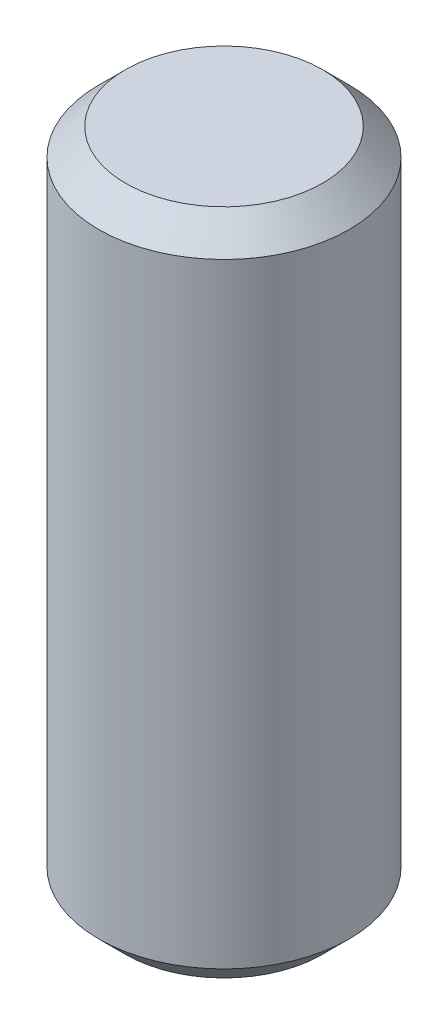
ISO-10303-21;
HEADER;
FILE_DESCRIPTION(('STEP AP214'),'2;1');
FILE_NAME('part.step','',(''),(''),'','','');
FILE_SCHEMA(('AUTOMOTIVE_DESIGN { 1 0 10303 214 1 1 1 1 }'));
ENDSEC;
DATA;
#1=APPLICATION_CONTEXT('core data for automotive mechanical design processes');
#2=APPLICATION_PROTOCOL_DEFINITION('international standard','automotive_design',2000,#1);
#3=PRODUCT_CONTEXT('',#1,'mechanical');
#4=PRODUCT('Part','Part','',(#3));
#5=PRODUCT_RELATED_PRODUCT_CATEGORY('part','',(#4));
#6=PRODUCT_DEFINITION_FORMATION('','',#4);
#7=PRODUCT_DEFINITION_CONTEXT('part definition',#1,'design');
#8=PRODUCT_DEFINITION('design','',#6,#7);
#9=PRODUCT_DEFINITION_SHAPE('','',#8);
#10=(LENGTH_UNIT() NAMED_UNIT(*) SI_UNIT(.MILLI.,.METRE.));
#11=(NAMED_UNIT(*) PLANE_ANGLE_UNIT() SI_UNIT($,.RADIAN.));
#12=(NAMED_UNIT(*) SI_UNIT($,.STERADIAN.) SOLID_ANGLE_UNIT());
#13=UNCERTAINTY_MEASURE_WITH_UNIT(LENGTH_MEASURE(1.E-05),#10,'distance_accuracy_value','');
#14=(GEOMETRIC_REPRESENTATION_CONTEXT(3) GLOBAL_UNCERTAINTY_ASSIGNED_CONTEXT((#13)) GLOBAL_UNIT_ASSIGNED_CONTEXT((#10,
#11,#12)) REPRESENTATION_CONTEXT('',''));
#15=CARTESIAN_POINT('',(0.,0.,0.));
#16=DIRECTION('',(0.,0.,1.));
#17=DIRECTION('',(1.,0.,0.));
#18=AXIS2_PLACEMENT_3D('',#15,#16,#17);
#19=CARTESIAN_POINT('',(0.,-3.175,0.));
#20=DIRECTION('',(0.,1.,0.));
#21=DIRECTION('',(0.,0.,1.));
#22=AXIS2_PLACEMENT_3D('',#19,#20,#21);
#23=PLANE('',#22);
#24=CARTESIAN_POINT('',(0.,-3.175,0.));
#25=DIRECTION('',(0.,1.,0.));
#26=DIRECTION('',(0.,0.,1.));
#27=AXIS2_PLACEMENT_3D('',#24,#25,#26);
#28=CIRCLE('',#27,0.936625000000001);
#29=CARTESIAN_POINT('',(0.,-3.175,0.936625000000001));
#30=VERTEX_POINT('',#29);
#31=EDGE_CURVE('E37',#30,#30,#28,.F.);
#32=ORIENTED_EDGE('',*,*,#31,.T.);
#33=EDGE_LOOP('',(#32));
#34=FACE_BOUND('',#33,.T.);
#35=ADVANCED_FACE('F30',(#34),#23,.F.);
#36=CARTESIAN_POINT('',(0.,0.760475273186752,0.));
#37=DIRECTION('',(0.,1.,0.));
#38=DIRECTION('',(0.,0.,1.));
#39=AXIS2_PLACEMENT_3D('',#36,#37,#38);
#40=CYLINDRICAL_SURFACE('',#39,1.190625);
#41=CARTESIAN_POINT('',(0.,-2.921,0.));
#42=DIRECTION('',(0.,1.,0.));
#43=DIRECTION('',(0.,0.,1.));
#44=AXIS2_PLACEMENT_3D('',#41,#42,#43);
#45=CIRCLE('',#44,1.190625);
#46=CARTESIAN_POINT('',(0.,-2.921,1.190625));
#47=VERTEX_POINT('',#46);
#48=EDGE_CURVE('E41',#47,#47,#45,.T.);
#49=ORIENTED_EDGE('',*,*,#48,.T.);
#50=EDGE_LOOP('',(#49));
#51=FACE_BOUND('',#50,.T.);
#52=CARTESIAN_POINT('',(0.,2.921,0.));
#53=DIRECTION('',(0.,-1.,0.));
#54=DIRECTION('',(0.,0.,-1.));
#55=AXIS2_PLACEMENT_3D('',#52,#53,#54);
#56=CIRCLE('',#55,1.190625);
#57=CARTESIAN_POINT('',(0.,2.921,-1.190625));
#58=VERTEX_POINT('',#57);
#59=EDGE_CURVE('E45',#58,#58,#56,.T.);
#60=ORIENTED_EDGE('',*,*,#59,.T.);
#61=EDGE_LOOP('',(#60));
#62=FACE_BOUND('',#61,.T.);
#63=ADVANCED_FACE('F51',(#51,#62),#40,.T.);
#64=CARTESIAN_POINT('',(1.190625,3.175,0.));
#65=DIRECTION('',(0.,-1.,0.));
#66=DIRECTION('',(0.,0.,-1.));
#67=AXIS2_PLACEMENT_3D('',#64,#65,#66);
#68=PLANE('',#67);
#69=CARTESIAN_POINT('',(0.,3.175,0.));
#70=DIRECTION('',(0.,-1.,0.));
#71=DIRECTION('',(0.,0.,-1.));
#72=AXIS2_PLACEMENT_3D('',#69,#70,#71);
#73=CIRCLE('',#72,0.936624999999998);
#74=CARTESIAN_POINT('',(0.,3.175,-0.936624999999998));
#75=VERTEX_POINT('',#74);
#76=EDGE_CURVE('E10',#75,#75,#73,.F.);
#77=ORIENTED_EDGE('',*,*,#76,.T.);
#78=EDGE_LOOP('',(#77));
#79=FACE_BOUND('',#78,.T.);
#80=ADVANCED_FACE('F59',(#79),#68,.F.);
#81=CARTESIAN_POINT('',(0.,-2.921,0.));
#82=DIRECTION('',(0.,1.,0.));
#83=DIRECTION('',(0.,0.,1.));
#84=AXIS2_PLACEMENT_3D('',#81,#82,#83);
#85=CONICAL_SURFACE('',#84,1.190625,0.785398163397449);
#86=ORIENTED_EDGE('',*,*,#31,.F.);
#87=EDGE_LOOP('',(#86));
#88=FACE_BOUND('',#87,.T.);
#89=ORIENTED_EDGE('',*,*,#48,.F.);
#90=EDGE_LOOP('',(#89));
#91=FACE_BOUND('',#90,.T.);
#92=ADVANCED_FACE('F55',(#88,#91),#85,.T.);
#93=CARTESIAN_POINT('',(0.,3.175,0.));
#94=DIRECTION('',(0.,-1.,0.));
#95=DIRECTION('',(0.,0.,-1.));
#96=AXIS2_PLACEMENT_3D('',#93,#94,#95);
#97=CONICAL_SURFACE('',#96,0.936624999999998,0.785398163397447);
#98=ORIENTED_EDGE('',*,*,#59,.F.);
#99=EDGE_LOOP('',(#98));
#100=FACE_BOUND('',#99,.T.);
#101=ORIENTED_EDGE('',*,*,#76,.F.);
#102=EDGE_LOOP('',(#101));
#103=FACE_BOUND('',#102,.T.);
#104=ADVANCED_FACE('F32',(#100,#103),#97,.T.);
#105=CLOSED_SHELL('',(#35,#63,#80,#92,#104));
#106=MANIFOLD_SOLID_BREP('B2',#105);
#107=ADVANCED_BREP_SHAPE_REPRESENTATION('',(#18,#106),#14);
#108=SHAPE_DEFINITION_REPRESENTATION(#9,#107);
ENDSEC;
END-ISO-10303-21;
